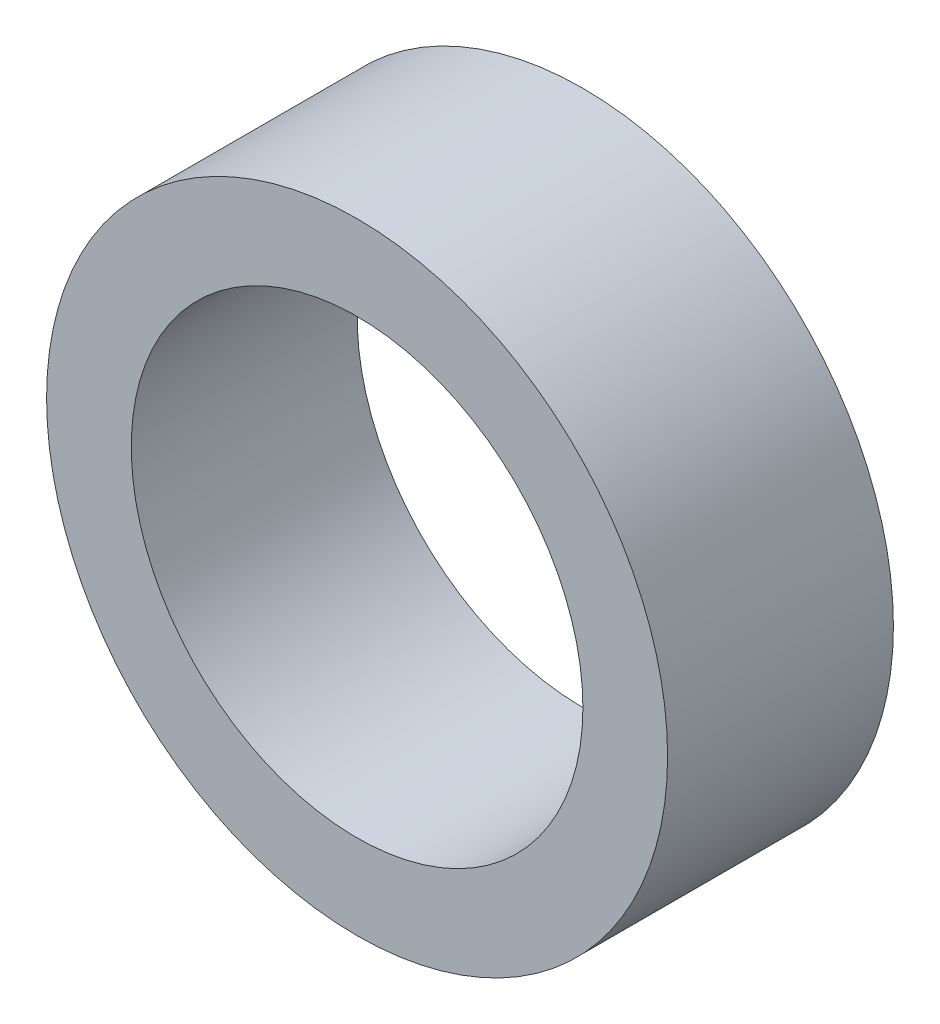
ISO-10303-21;
HEADER;
FILE_DESCRIPTION(('STEP AP214'),'2;1');
FILE_NAME('part.step','',(''),(''),'','','');
FILE_SCHEMA(('AUTOMOTIVE_DESIGN { 1 0 10303 214 1 1 1 1 }'));
ENDSEC;
DATA;
#1=APPLICATION_CONTEXT('core data for automotive mechanical design processes');
#2=APPLICATION_PROTOCOL_DEFINITION('international standard','automotive_design',2000,#1);
#3=PRODUCT_CONTEXT('',#1,'mechanical');
#4=PRODUCT('Part','Part','',(#3));
#5=PRODUCT_RELATED_PRODUCT_CATEGORY('part','',(#4));
#6=PRODUCT_DEFINITION_FORMATION('','',#4);
#7=PRODUCT_DEFINITION_CONTEXT('part definition',#1,'design');
#8=PRODUCT_DEFINITION('design','',#6,#7);
#9=PRODUCT_DEFINITION_SHAPE('','',#8);
#10=(LENGTH_UNIT() NAMED_UNIT(*) SI_UNIT(.MILLI.,.METRE.));
#11=(NAMED_UNIT(*) PLANE_ANGLE_UNIT() SI_UNIT($,.RADIAN.));
#12=(NAMED_UNIT(*) SI_UNIT($,.STERADIAN.) SOLID_ANGLE_UNIT());
#13=UNCERTAINTY_MEASURE_WITH_UNIT(LENGTH_MEASURE(1.E-05),#10,'distance_accuracy_value','');
#14=(GEOMETRIC_REPRESENTATION_CONTEXT(3) GLOBAL_UNCERTAINTY_ASSIGNED_CONTEXT((#13)) GLOBAL_UNIT_ASSIGNED_CONTEXT((#10,
#11,#12)) REPRESENTATION_CONTEXT('',''));
#15=CARTESIAN_POINT('',(0.,0.,0.));
#16=DIRECTION('',(0.,0.,1.));
#17=DIRECTION('',(1.,0.,0.));
#18=AXIS2_PLACEMENT_3D('',#15,#16,#17);
#19=CARTESIAN_POINT('',(0.,0.,8.));
#20=DIRECTION('',(0.,0.,1.));
#21=DIRECTION('',(1.,0.,0.));
#22=AXIS2_PLACEMENT_3D('',#19,#20,#21);
#23=PLANE('',#22);
#24=CARTESIAN_POINT('',(0.,0.,8.));
#25=DIRECTION('',(0.,0.,1.));
#26=DIRECTION('',(1.,0.,0.));
#27=AXIS2_PLACEMENT_3D('',#24,#25,#26);
#28=CIRCLE('',#27,11.);
#29=CARTESIAN_POINT('',(11.,0.,8.));
#30=VERTEX_POINT('',#29);
#31=EDGE_CURVE('E10',#30,#30,#28,.T.);
#32=ORIENTED_EDGE('',*,*,#31,.T.);
#33=EDGE_LOOP('',(#32));
#34=FACE_BOUND('',#33,.T.);
#35=CARTESIAN_POINT('',(0.,0.,8.));
#36=DIRECTION('',(0.,0.,1.));
#37=DIRECTION('',(1.,0.,0.));
#38=AXIS2_PLACEMENT_3D('',#35,#36,#37);
#39=CIRCLE('',#38,8.);
#40=CARTESIAN_POINT('',(8.,0.,8.));
#41=VERTEX_POINT('',#40);
#42=EDGE_CURVE('E42',#41,#41,#39,.T.);
#43=ORIENTED_EDGE('',*,*,#42,.F.);
#44=EDGE_LOOP('',(#43));
#45=FACE_BOUND('',#44,.T.);
#46=ADVANCED_FACE('F31',(#34,#45),#23,.T.);
#47=CARTESIAN_POINT('',(0.,0.,0.));
#48=DIRECTION('',(0.,0.,1.));
#49=DIRECTION('',(1.,0.,0.));
#50=AXIS2_PLACEMENT_3D('',#47,#48,#49);
#51=PLANE('',#50);
#52=CARTESIAN_POINT('',(0.,0.,0.));
#53=DIRECTION('',(0.,0.,1.));
#54=DIRECTION('',(1.,0.,0.));
#55=AXIS2_PLACEMENT_3D('',#52,#53,#54);
#56=CIRCLE('',#55,11.);
#57=CARTESIAN_POINT('',(11.,0.,0.));
#58=VERTEX_POINT('',#57);
#59=EDGE_CURVE('E35',#58,#58,#56,.T.);
#60=ORIENTED_EDGE('',*,*,#59,.F.);
#61=EDGE_LOOP('',(#60));
#62=FACE_BOUND('',#61,.T.);
#63=CARTESIAN_POINT('',(0.,0.,0.));
#64=DIRECTION('',(0.,0.,1.));
#65=DIRECTION('',(1.,0.,0.));
#66=AXIS2_PLACEMENT_3D('',#63,#64,#65);
#67=CIRCLE('',#66,8.);
#68=CARTESIAN_POINT('',(8.,0.,0.));
#69=VERTEX_POINT('',#68);
#70=EDGE_CURVE('E44',#69,#69,#67,.T.);
#71=ORIENTED_EDGE('',*,*,#70,.T.);
#72=EDGE_LOOP('',(#71));
#73=FACE_BOUND('',#72,.T.);
#74=ADVANCED_FACE('F54',(#62,#73),#51,.F.);
#75=CARTESIAN_POINT('',(0.,0.,8.));
#76=DIRECTION('',(0.,0.,-1.));
#77=DIRECTION('',(-1.,0.,0.));
#78=AXIS2_PLACEMENT_3D('',#75,#76,#77);
#79=CYLINDRICAL_SURFACE('',#78,11.);
#80=ORIENTED_EDGE('',*,*,#31,.F.);
#81=EDGE_LOOP('',(#80));
#82=FACE_BOUND('',#81,.T.);
#83=ORIENTED_EDGE('',*,*,#59,.T.);
#84=EDGE_LOOP('',(#83));
#85=FACE_BOUND('',#84,.T.);
#86=ADVANCED_FACE('F33',(#82,#85),#79,.T.);
#87=CARTESIAN_POINT('',(0.,0.,8.));
#88=DIRECTION('',(0.,0.,-1.));
#89=DIRECTION('',(-1.,0.,0.));
#90=AXIS2_PLACEMENT_3D('',#87,#88,#89);
#91=CYLINDRICAL_SURFACE('',#90,8.);
#92=ORIENTED_EDGE('',*,*,#42,.T.);
#93=EDGE_LOOP('',(#92));
#94=FACE_BOUND('',#93,.T.);
#95=ORIENTED_EDGE('',*,*,#70,.F.);
#96=EDGE_LOOP('',(#95));
#97=FACE_BOUND('',#96,.T.);
#98=ADVANCED_FACE('F50',(#94,#97),#91,.F.);
#99=CLOSED_SHELL('',(#46,#74,#86,#98));
#100=MANIFOLD_SOLID_BREP('B2',#99);
#101=ADVANCED_BREP_SHAPE_REPRESENTATION('',(#18,#100),#14);
#102=SHAPE_DEFINITION_REPRESENTATION(#9,#101);
ENDSEC;
END-ISO-10303-21;
